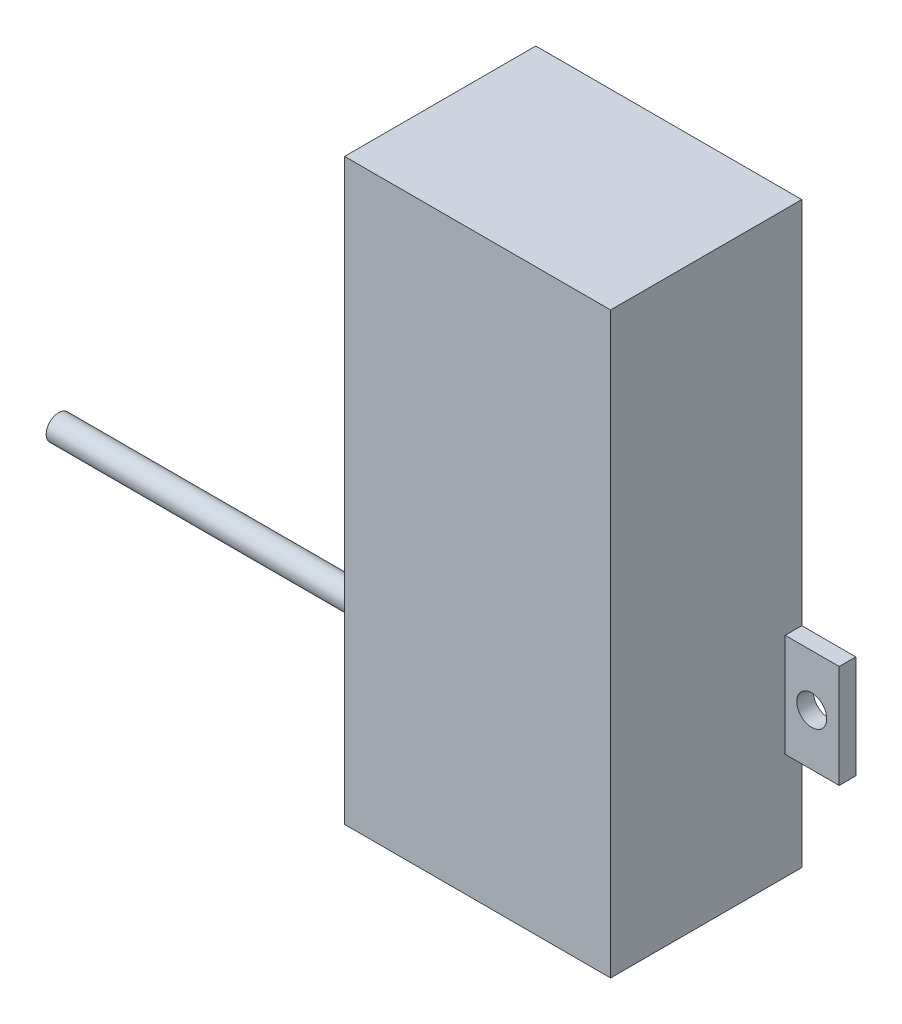
ISO-10303-21;
HEADER;
FILE_DESCRIPTION(('STEP AP214'),'2;1');
FILE_NAME('part.step','',(''),(''),'','','');
FILE_SCHEMA(('AUTOMOTIVE_DESIGN { 1 0 10303 214 1 1 1 1 }'));
ENDSEC;
DATA;
#1=APPLICATION_CONTEXT('core data for automotive mechanical design processes');
#2=APPLICATION_PROTOCOL_DEFINITION('international standard','automotive_design',2000,#1);
#3=PRODUCT_CONTEXT('',#1,'mechanical');
#4=PRODUCT('Part','Part','',(#3));
#5=PRODUCT_RELATED_PRODUCT_CATEGORY('part','',(#4));
#6=PRODUCT_DEFINITION_FORMATION('','',#4);
#7=PRODUCT_DEFINITION_CONTEXT('part definition',#1,'design');
#8=PRODUCT_DEFINITION('design','',#6,#7);
#9=PRODUCT_DEFINITION_SHAPE('','',#8);
#10=(LENGTH_UNIT() NAMED_UNIT(*) SI_UNIT(.MILLI.,.METRE.));
#11=(NAMED_UNIT(*) PLANE_ANGLE_UNIT() SI_UNIT($,.RADIAN.));
#12=(NAMED_UNIT(*) SI_UNIT($,.STERADIAN.) SOLID_ANGLE_UNIT());
#13=UNCERTAINTY_MEASURE_WITH_UNIT(LENGTH_MEASURE(1.E-05),#10,'distance_accuracy_value','');
#14=(GEOMETRIC_REPRESENTATION_CONTEXT(3) GLOBAL_UNCERTAINTY_ASSIGNED_CONTEXT((#13)) GLOBAL_UNIT_ASSIGNED_CONTEXT((#10,
#11,#12)) REPRESENTATION_CONTEXT('',''));
#15=CARTESIAN_POINT('',(0.,0.,0.));
#16=DIRECTION('',(0.,0.,1.));
#17=DIRECTION('',(1.,0.,0.));
#18=AXIS2_PLACEMENT_3D('',#15,#16,#17);
#19=CARTESIAN_POINT('',(34.2790620031797,29.2729411764706,23.));
#20=DIRECTION('',(-1.,0.,0.));
#21=DIRECTION('',(0.,0.,1.));
#22=AXIS2_PLACEMENT_3D('',#19,#20,#21);
#23=PLANE('',#22);
#24=CARTESIAN_POINT('',(34.2790620031797,-27.6270588235294,11.5));
#25=DIRECTION('',(-1.,0.,0.));
#26=DIRECTION('',(0.,0.,1.));
#27=AXIS2_PLACEMENT_3D('',#24,#25,#26);
#28=CIRCLE('',#27,1.5);
#29=CARTESIAN_POINT('',(34.2790620031797,-27.6270588235294,13.));
#30=VERTEX_POINT('',#29);
#31=EDGE_CURVE('E47',#30,#30,#28,.T.);
#32=ORIENTED_EDGE('',*,*,#31,.F.);
#33=EDGE_LOOP('',(#32));
#34=FACE_BOUND('',#33,.T.);
#35=DIRECTION('',(0.,-1.,0.));
#36=VECTOR('',#35,1.);
#37=CARTESIAN_POINT('',(34.2790620031797,-19.5220896505135,2.));
#38=LINE('',#37,#36);
#39=CARTESIAN_POINT('',(34.2790620031797,-15.1220896505135,2.));
#40=VERTEX_POINT('',#39);
#41=CARTESIAN_POINT('',(34.2790620031797,-28.4172027618297,2.));
#42=VERTEX_POINT('',#41);
#43=EDGE_CURVE('E157',#40,#42,#38,.T.);
#44=ORIENTED_EDGE('',*,*,#43,.T.);
#45=DIRECTION('',(0.,0.,1.));
#46=VECTOR('',#45,1.);
#47=CARTESIAN_POINT('',(34.2790620031797,-28.4172027618297,23.));
#48=LINE('',#47,#46);
#49=CARTESIAN_POINT('',(34.2790620031797,-28.4172027618297,0.));
#50=VERTEX_POINT('',#49);
#51=EDGE_CURVE('E11',#50,#42,#48,.T.);
#52=ORIENTED_EDGE('',*,*,#51,.F.);
#53=DIRECTION('',(0.,1.,0.));
#54=VECTOR('',#53,1.);
#55=CARTESIAN_POINT('',(34.2790620031797,29.2729411764706,0.));
#56=LINE('',#55,#54);
#57=CARTESIAN_POINT('',(34.2790620031797,-40.3270588235294,0.));
#58=VERTEX_POINT('',#57);
#59=EDGE_CURVE('E143',#58,#50,#56,.T.);
#60=ORIENTED_EDGE('',*,*,#59,.F.);
#61=DIRECTION('',(0.,0.,-1.));
#62=VECTOR('',#61,1.);
#63=CARTESIAN_POINT('',(34.2790620031797,-40.3270588235294,23.));
#64=LINE('',#63,#62);
#65=CARTESIAN_POINT('',(34.2790620031797,-40.3270588235294,23.));
#66=VERTEX_POINT('',#65);
#67=EDGE_CURVE('E174',#66,#58,#64,.T.);
#68=ORIENTED_EDGE('',*,*,#67,.F.);
#69=DIRECTION('',(0.,1.,0.));
#70=VECTOR('',#69,1.);
#71=CARTESIAN_POINT('',(34.2790620031797,29.2729411764706,23.));
#72=LINE('',#71,#70);
#73=CARTESIAN_POINT('',(34.2790620031797,29.2729411764706,23.));
#74=VERTEX_POINT('',#73);
#75=EDGE_CURVE('E171',#66,#74,#72,.T.);
#76=ORIENTED_EDGE('',*,*,#75,.T.);
#77=DIRECTION('',(0.,0.,-1.));
#78=VECTOR('',#77,1.);
#79=CARTESIAN_POINT('',(34.2790620031797,29.2729411764706,23.));
#80=LINE('',#79,#78);
#81=CARTESIAN_POINT('',(34.2790620031797,29.2729411764706,0.));
#82=VERTEX_POINT('',#81);
#83=EDGE_CURVE('E178',#74,#82,#80,.T.);
#84=ORIENTED_EDGE('',*,*,#83,.T.);
#85=CARTESIAN_POINT('',(34.2790620031797,-15.1220896505135,0.));
#86=VERTEX_POINT('',#85);
#87=EDGE_CURVE('E170',#86,#82,#56,.T.);
#88=ORIENTED_EDGE('',*,*,#87,.F.);
#89=DIRECTION('',(0.,0.,1.));
#90=VECTOR('',#89,1.);
#91=CARTESIAN_POINT('',(34.2790620031797,-15.1220896505135,0.));
#92=LINE('',#91,#90);
#93=EDGE_CURVE('E58',#86,#40,#92,.T.);
#94=ORIENTED_EDGE('',*,*,#93,.T.);
#95=EDGE_LOOP('',(#44,#52,#60,#68,#76,#84,#88,#94));
#96=FACE_BOUND('',#95,.T.);
#97=ADVANCED_FACE('F39',(#34,#96),#23,.T.);
#98=CARTESIAN_POINT('',(66.2790620031797,29.2729411764706,23.));
#99=DIRECTION('',(-1.,0.,0.));
#100=DIRECTION('',(0.,0.,1.));
#101=AXIS2_PLACEMENT_3D('',#98,#99,#100);
#102=PLANE('',#101);
#103=DIRECTION('',(0.,0.,1.));
#104=VECTOR('',#103,1.);
#105=CARTESIAN_POINT('',(66.2790620031797,-27.5220896505135,0.));
#106=LINE('',#105,#104);
#107=CARTESIAN_POINT('',(66.2790620031797,-27.5220896505135,0.));
#108=VERTEX_POINT('',#107);
#109=CARTESIAN_POINT('',(66.2790620031797,-27.5220896505135,2.));
#110=VERTEX_POINT('',#109);
#111=EDGE_CURVE('E181',#108,#110,#106,.T.);
#112=ORIENTED_EDGE('',*,*,#111,.T.);
#113=DIRECTION('',(0.,-1.,0.));
#114=VECTOR('',#113,1.);
#115=CARTESIAN_POINT('',(66.2790620031797,-19.5220896505135,2.));
#116=LINE('',#115,#114);
#117=CARTESIAN_POINT('',(66.2790620031797,-15.1220896505135,2.));
#118=VERTEX_POINT('',#117);
#119=EDGE_CURVE('E198',#118,#110,#116,.T.);
#120=ORIENTED_EDGE('',*,*,#119,.F.);
#121=DIRECTION('',(0.,0.,1.));
#122=VECTOR('',#121,1.);
#123=CARTESIAN_POINT('',(66.2790620031797,-15.1220896505135,0.));
#124=LINE('',#123,#122);
#125=CARTESIAN_POINT('',(66.2790620031797,-15.1220896505135,0.));
#126=VERTEX_POINT('',#125);
#127=EDGE_CURVE('E193',#126,#118,#124,.T.);
#128=ORIENTED_EDGE('',*,*,#127,.F.);
#129=DIRECTION('',(0.,1.,0.));
#130=VECTOR('',#129,1.);
#131=CARTESIAN_POINT('',(66.2790620031797,29.2729411764706,0.));
#132=LINE('',#131,#130);
#133=CARTESIAN_POINT('',(66.2790620031797,29.2729411764706,0.));
#134=VERTEX_POINT('',#133);
#135=EDGE_CURVE('E219',#126,#134,#132,.T.);
#136=ORIENTED_EDGE('',*,*,#135,.T.);
#137=DIRECTION('',(0.,0.,-1.));
#138=VECTOR('',#137,1.);
#139=CARTESIAN_POINT('',(66.2790620031797,29.2729411764706,23.));
#140=LINE('',#139,#138);
#141=CARTESIAN_POINT('',(66.2790620031797,29.2729411764706,23.));
#142=VERTEX_POINT('',#141);
#143=EDGE_CURVE('E217',#142,#134,#140,.T.);
#144=ORIENTED_EDGE('',*,*,#143,.F.);
#145=DIRECTION('',(0.,1.,0.));
#146=VECTOR('',#145,1.);
#147=CARTESIAN_POINT('',(66.2790620031797,29.2729411764706,23.));
#148=LINE('',#147,#146);
#149=CARTESIAN_POINT('',(66.2790620031797,-40.3270588235294,23.));
#150=VERTEX_POINT('',#149);
#151=EDGE_CURVE('E212',#150,#142,#148,.T.);
#152=ORIENTED_EDGE('',*,*,#151,.F.);
#153=DIRECTION('',(0.,0.,-1.));
#154=VECTOR('',#153,1.);
#155=CARTESIAN_POINT('',(66.2790620031797,-40.3270588235294,23.));
#156=LINE('',#155,#154);
#157=CARTESIAN_POINT('',(66.2790620031797,-40.3270588235294,0.));
#158=VERTEX_POINT('',#157);
#159=EDGE_CURVE('E226',#150,#158,#156,.T.);
#160=ORIENTED_EDGE('',*,*,#159,.T.);
#161=EDGE_CURVE('E220',#158,#108,#132,.T.);
#162=ORIENTED_EDGE('',*,*,#161,.T.);
#163=EDGE_LOOP('',(#112,#120,#128,#136,#144,#152,#160,#162));
#164=FACE_BOUND('',#163,.T.);
#165=ADVANCED_FACE('F234',(#164),#102,.F.);
#166=CARTESIAN_POINT('',(0.,0.,0.));
#167=DIRECTION('',(0.,0.,1.));
#168=DIRECTION('',(1.,0.,0.));
#169=AXIS2_PLACEMENT_3D('',#166,#167,#168);
#170=PLANE('',#169);
#171=CARTESIAN_POINT('',(31.0771714081852,-21.7720896505135,0.));
#172=DIRECTION('',(0.,0.,1.));
#173=DIRECTION('',(1.,0.,0.));
#174=AXIS2_PLACEMENT_3D('',#171,#172,#173);
#175=CIRCLE('',#174,1.79810940500553);
#176=CARTESIAN_POINT('',(32.8752808131908,-21.7720896505135,0.));
#177=VERTEX_POINT('',#176);
#178=EDGE_CURVE('E327',#177,#177,#175,.T.);
#179=ORIENTED_EDGE('',*,*,#178,.T.);
#180=EDGE_LOOP('',(#179));
#181=FACE_BOUND('',#180,.T.);
#182=ORIENTED_EDGE('',*,*,#59,.T.);
#183=DIRECTION('',(-1.,0.,0.));
#184=VECTOR('',#183,1.);
#185=CARTESIAN_POINT('',(35.2790620031797,-28.4172027618297,0.));
#186=LINE('',#185,#184);
#187=CARTESIAN_POINT('',(27.7790620031797,-28.4172027618297,0.));
#188=VERTEX_POINT('',#187);
#189=EDGE_CURVE('E140',#50,#188,#186,.T.);
#190=ORIENTED_EDGE('',*,*,#189,.T.);
#191=DIRECTION('',(0.,1.,0.));
#192=VECTOR('',#191,1.);
#193=CARTESIAN_POINT('',(27.7790620031797,-19.5220896505135,0.));
#194=LINE('',#193,#192);
#195=CARTESIAN_POINT('',(27.7790620031797,-15.1220896505135,0.));
#196=VERTEX_POINT('',#195);
#197=EDGE_CURVE('E127',#188,#196,#194,.T.);
#198=ORIENTED_EDGE('',*,*,#197,.T.);
#199=DIRECTION('',(1.,0.,0.));
#200=VECTOR('',#199,1.);
#201=CARTESIAN_POINT('',(27.7790620031797,-15.1220896505135,0.));
#202=LINE('',#201,#200);
#203=EDGE_CURVE('E161',#196,#86,#202,.T.);
#204=ORIENTED_EDGE('',*,*,#203,.T.);
#205=ORIENTED_EDGE('',*,*,#87,.T.);
#206=DIRECTION('',(-1.,0.,0.));
#207=VECTOR('',#206,1.);
#208=CARTESIAN_POINT('',(34.2790620031797,29.2729411764706,0.));
#209=LINE('',#208,#207);
#210=EDGE_CURVE('E213',#134,#82,#209,.T.);
#211=ORIENTED_EDGE('',*,*,#210,.F.);
#212=ORIENTED_EDGE('',*,*,#135,.F.);
#213=DIRECTION('',(-1.,0.,0.));
#214=VECTOR('',#213,1.);
#215=CARTESIAN_POINT('',(72.7790620031797,-15.1220896505135,0.));
#216=LINE('',#215,#214);
#217=CARTESIAN_POINT('',(72.7790620031797,-15.1220896505135,0.));
#218=VERTEX_POINT('',#217);
#219=EDGE_CURVE('E207',#218,#126,#216,.T.);
#220=ORIENTED_EDGE('',*,*,#219,.F.);
#221=DIRECTION('',(0.,1.,0.));
#222=VECTOR('',#221,1.);
#223=CARTESIAN_POINT('',(72.7790620031797,-19.5220896505135,0.));
#224=LINE('',#223,#222);
#225=CARTESIAN_POINT('',(72.7790620031797,-27.5220896505135,0.));
#226=VERTEX_POINT('',#225);
#227=EDGE_CURVE('E194',#226,#218,#224,.T.);
#228=ORIENTED_EDGE('',*,*,#227,.F.);
#229=DIRECTION('',(-1.,0.,0.));
#230=VECTOR('',#229,1.);
#231=CARTESIAN_POINT('',(72.7790620031797,-27.5220896505135,0.));
#232=LINE('',#231,#230);
#233=EDGE_CURVE('E185',#226,#108,#232,.T.);
#234=ORIENTED_EDGE('',*,*,#233,.T.);
#235=ORIENTED_EDGE('',*,*,#161,.F.);
#236=DIRECTION('',(1.,0.,0.));
#237=VECTOR('',#236,1.);
#238=CARTESIAN_POINT('',(34.2790620031797,-40.3270588235294,0.));
#239=LINE('',#238,#237);
#240=EDGE_CURVE('E209',#58,#158,#239,.T.);
#241=ORIENTED_EDGE('',*,*,#240,.F.);
#242=EDGE_LOOP('',(#182,#190,#198,#204,#205,#211,#212,#220,#228,#234,#235,#241));
#243=FACE_BOUND('',#242,.T.);
#244=CARTESIAN_POINT('',(69.4772948209206,-21.3220896505135,0.));
#245=DIRECTION('',(0.,0.,1.));
#246=DIRECTION('',(1.,0.,0.));
#247=AXIS2_PLACEMENT_3D('',#244,#245,#246);
#248=CIRCLE('',#247,1.80176718225915);
#249=CARTESIAN_POINT('',(71.2790620031797,-21.3220896505135,0.));
#250=VERTEX_POINT('',#249);
#251=EDGE_CURVE('E150',#250,#250,#248,.T.);
#252=ORIENTED_EDGE('',*,*,#251,.T.);
#253=EDGE_LOOP('',(#252));
#254=FACE_BOUND('',#253,.T.);
#255=ADVANCED_FACE('F141',(#181,#243,#254),#170,.F.);
#256=CARTESIAN_POINT('',(34.2790620031797,-40.3270588235294,23.));
#257=DIRECTION('',(0.,1.,0.));
#258=DIRECTION('',(0.,0.,1.));
#259=AXIS2_PLACEMENT_3D('',#256,#257,#258);
#260=PLANE('',#259);
#261=DIRECTION('',(1.,0.,0.));
#262=VECTOR('',#261,1.);
#263=CARTESIAN_POINT('',(34.2790620031797,-40.3270588235294,23.));
#264=LINE('',#263,#262);
#265=EDGE_CURVE('E210',#66,#150,#264,.T.);
#266=ORIENTED_EDGE('',*,*,#265,.F.);
#267=ORIENTED_EDGE('',*,*,#67,.T.);
#268=ORIENTED_EDGE('',*,*,#240,.T.);
#269=ORIENTED_EDGE('',*,*,#159,.F.);
#270=EDGE_LOOP('',(#266,#267,#268,#269));
#271=FACE_BOUND('',#270,.T.);
#272=ADVANCED_FACE('F41',(#271),#260,.F.);
#273=CARTESIAN_POINT('',(34.2790620031797,29.2729411764706,23.));
#274=DIRECTION('',(0.,-1.,0.));
#275=DIRECTION('',(0.,0.,-1.));
#276=AXIS2_PLACEMENT_3D('',#273,#274,#275);
#277=PLANE('',#276);
#278=ORIENTED_EDGE('',*,*,#210,.T.);
#279=ORIENTED_EDGE('',*,*,#83,.F.);
#280=DIRECTION('',(-1.,0.,0.));
#281=VECTOR('',#280,1.);
#282=CARTESIAN_POINT('',(34.2790620031797,29.2729411764706,23.));
#283=LINE('',#282,#281);
#284=EDGE_CURVE('E215',#142,#74,#283,.T.);
#285=ORIENTED_EDGE('',*,*,#284,.F.);
#286=ORIENTED_EDGE('',*,*,#143,.T.);
#287=EDGE_LOOP('',(#278,#279,#285,#286));
#288=FACE_BOUND('',#287,.T.);
#289=ADVANCED_FACE('F245',(#288),#277,.F.);
#290=CARTESIAN_POINT('',(0.,0.,23.));
#291=DIRECTION('',(0.,0.,1.));
#292=DIRECTION('',(1.,0.,0.));
#293=AXIS2_PLACEMENT_3D('',#290,#291,#292);
#294=PLANE('',#293);
#295=ORIENTED_EDGE('',*,*,#284,.T.);
#296=ORIENTED_EDGE('',*,*,#75,.F.);
#297=ORIENTED_EDGE('',*,*,#265,.T.);
#298=ORIENTED_EDGE('',*,*,#151,.T.);
#299=EDGE_LOOP('',(#295,#296,#297,#298));
#300=FACE_BOUND('',#299,.T.);
#301=ADVANCED_FACE('F251',(#300),#294,.T.);
#302=CARTESIAN_POINT('',(72.7790620031797,-15.1220896505135,0.));
#303=DIRECTION('',(0.,-1.,0.));
#304=DIRECTION('',(0.,0.,-1.));
#305=AXIS2_PLACEMENT_3D('',#302,#303,#304);
#306=PLANE('',#305);
#307=ORIENTED_EDGE('',*,*,#127,.T.);
#308=DIRECTION('',(-1.,0.,0.));
#309=VECTOR('',#308,1.);
#310=CARTESIAN_POINT('',(72.7790620031797,-15.1220896505135,2.));
#311=LINE('',#310,#309);
#312=CARTESIAN_POINT('',(72.7790620031797,-15.1220896505135,2.));
#313=VERTEX_POINT('',#312);
#314=EDGE_CURVE('E202',#313,#118,#311,.T.);
#315=ORIENTED_EDGE('',*,*,#314,.F.);
#316=DIRECTION('',(0.,0.,1.));
#317=VECTOR('',#316,1.);
#318=CARTESIAN_POINT('',(72.7790620031797,-15.1220896505135,0.));
#319=LINE('',#318,#317);
#320=EDGE_CURVE('E197',#218,#313,#319,.T.);
#321=ORIENTED_EDGE('',*,*,#320,.F.);
#322=ORIENTED_EDGE('',*,*,#219,.T.);
#323=EDGE_LOOP('',(#307,#315,#321,#322));
#324=FACE_BOUND('',#323,.T.);
#325=ADVANCED_FACE('F260',(#324),#306,.F.);
#326=CARTESIAN_POINT('',(72.7790620031797,-19.5220896505135,2.));
#327=DIRECTION('',(0.,0.,-1.));
#328=DIRECTION('',(-1.,0.,0.));
#329=AXIS2_PLACEMENT_3D('',#326,#327,#328);
#330=PLANE('',#329);
#331=CARTESIAN_POINT('',(69.4772948209206,-21.3220896505135,2.));
#332=DIRECTION('',(0.,0.,1.));
#333=DIRECTION('',(1.,0.,0.));
#334=AXIS2_PLACEMENT_3D('',#331,#332,#333);
#335=CIRCLE('',#334,1.80176718225915);
#336=CARTESIAN_POINT('',(71.2790620031797,-21.3220896505135,2.));
#337=VERTEX_POINT('',#336);
#338=EDGE_CURVE('E153',#337,#337,#335,.T.);
#339=ORIENTED_EDGE('',*,*,#338,.F.);
#340=EDGE_LOOP('',(#339));
#341=FACE_BOUND('',#340,.T.);
#342=ORIENTED_EDGE('',*,*,#119,.T.);
#343=DIRECTION('',(-1.,0.,0.));
#344=VECTOR('',#343,1.);
#345=CARTESIAN_POINT('',(72.7790620031797,-27.5220896505135,2.));
#346=LINE('',#345,#344);
#347=CARTESIAN_POINT('',(72.7790620031797,-27.5220896505135,2.));
#348=VERTEX_POINT('',#347);
#349=EDGE_CURVE('E190',#348,#110,#346,.T.);
#350=ORIENTED_EDGE('',*,*,#349,.F.);
#351=DIRECTION('',(0.,-1.,0.));
#352=VECTOR('',#351,1.);
#353=CARTESIAN_POINT('',(72.7790620031797,-19.5220896505135,2.));
#354=LINE('',#353,#352);
#355=EDGE_CURVE('E200',#313,#348,#354,.T.);
#356=ORIENTED_EDGE('',*,*,#355,.F.);
#357=ORIENTED_EDGE('',*,*,#314,.T.);
#358=EDGE_LOOP('',(#342,#350,#356,#357));
#359=FACE_BOUND('',#358,.T.);
#360=ADVANCED_FACE('F289',(#341,#359),#330,.F.);
#361=CARTESIAN_POINT('',(72.7790620031797,0.,0.));
#362=DIRECTION('',(1.,0.,0.));
#363=DIRECTION('',(0.,0.,-1.));
#364=AXIS2_PLACEMENT_3D('',#361,#362,#363);
#365=PLANE('',#364);
#366=ORIENTED_EDGE('',*,*,#227,.T.);
#367=ORIENTED_EDGE('',*,*,#320,.T.);
#368=ORIENTED_EDGE('',*,*,#355,.T.);
#369=DIRECTION('',(0.,0.,1.));
#370=VECTOR('',#369,1.);
#371=CARTESIAN_POINT('',(72.7790620031797,-27.5220896505135,0.));
#372=LINE('',#371,#370);
#373=EDGE_CURVE('E182',#226,#348,#372,.T.);
#374=ORIENTED_EDGE('',*,*,#373,.F.);
#375=EDGE_LOOP('',(#366,#367,#368,#374));
#376=FACE_BOUND('',#375,.T.);
#377=ADVANCED_FACE('F265',(#376),#365,.T.);
#378=CARTESIAN_POINT('',(72.7790620031797,-27.5220896505135,0.));
#379=DIRECTION('',(0.,-1.,0.));
#380=DIRECTION('',(0.,0.,-1.));
#381=AXIS2_PLACEMENT_3D('',#378,#379,#380);
#382=PLANE('',#381);
#383=ORIENTED_EDGE('',*,*,#111,.F.);
#384=ORIENTED_EDGE('',*,*,#233,.F.);
#385=ORIENTED_EDGE('',*,*,#373,.T.);
#386=ORIENTED_EDGE('',*,*,#349,.T.);
#387=EDGE_LOOP('',(#383,#384,#385,#386));
#388=FACE_BOUND('',#387,.T.);
#389=ADVANCED_FACE('F269',(#388),#382,.T.);
#390=CARTESIAN_POINT('',(-11.6209379968203,-27.6270588235294,11.5));
#391=DIRECTION('',(1.,0.,0.));
#392=DIRECTION('',(0.,0.,-1.));
#393=AXIS2_PLACEMENT_3D('',#390,#391,#392);
#394=CYLINDRICAL_SURFACE('',#393,1.5);
#395=CARTESIAN_POINT('',(-11.6209379968203,-27.6270588235294,11.5));
#396=DIRECTION('',(1.,0.,0.));
#397=DIRECTION('',(0.,0.,-1.));
#398=AXIS2_PLACEMENT_3D('',#395,#396,#397);
#399=CIRCLE('',#398,1.5);
#400=CARTESIAN_POINT('',(-11.6209379968203,-27.6270588235294,10.));
#401=VERTEX_POINT('',#400);
#402=EDGE_CURVE('E167',#401,#401,#399,.T.);
#403=ORIENTED_EDGE('',*,*,#402,.T.);
#404=EDGE_LOOP('',(#403));
#405=FACE_BOUND('',#404,.T.);
#406=ORIENTED_EDGE('',*,*,#31,.T.);
#407=EDGE_LOOP('',(#406));
#408=FACE_BOUND('',#407,.T.);
#409=ADVANCED_FACE('F231',(#405,#408),#394,.T.);
#410=CARTESIAN_POINT('',(-11.6209379968203,0.,0.));
#411=DIRECTION('',(-1.,0.,0.));
#412=DIRECTION('',(0.,0.,-1.));
#413=AXIS2_PLACEMENT_3D('',#410,#411,#412);
#414=PLANE('',#413);
#415=ORIENTED_EDGE('',*,*,#402,.F.);
#416=EDGE_LOOP('',(#415));
#417=FACE_BOUND('',#416,.T.);
#418=ADVANCED_FACE('F299',(#417),#414,.T.);
#419=CARTESIAN_POINT('',(27.7790620031797,-19.5220896505135,2.));
#420=DIRECTION('',(0.,0.,1.));
#421=DIRECTION('',(1.,0.,0.));
#422=AXIS2_PLACEMENT_3D('',#419,#420,#421);
#423=PLANE('',#422);
#424=CARTESIAN_POINT('',(31.0771714081852,-21.7720896505135,2.));
#425=DIRECTION('',(0.,0.,1.));
#426=DIRECTION('',(1.,0.,0.));
#427=AXIS2_PLACEMENT_3D('',#424,#425,#426);
#428=CIRCLE('',#427,1.79810940500553);
#429=CARTESIAN_POINT('',(32.8752808131908,-21.7720896505135,2.));
#430=VERTEX_POINT('',#429);
#431=EDGE_CURVE('E325',#430,#430,#428,.T.);
#432=ORIENTED_EDGE('',*,*,#431,.F.);
#433=EDGE_LOOP('',(#432));
#434=FACE_BOUND('',#433,.T.);
#435=DIRECTION('',(-1.,0.,0.));
#436=VECTOR('',#435,1.);
#437=CARTESIAN_POINT('',(35.2790620031797,-28.4172027618297,2.));
#438=LINE('',#437,#436);
#439=CARTESIAN_POINT('',(27.7790620031797,-28.4172027618297,2.));
#440=VERTEX_POINT('',#439);
#441=EDGE_CURVE('E145',#42,#440,#438,.T.);
#442=ORIENTED_EDGE('',*,*,#441,.F.);
#443=ORIENTED_EDGE('',*,*,#43,.F.);
#444=DIRECTION('',(1.,0.,0.));
#445=VECTOR('',#444,1.);
#446=CARTESIAN_POINT('',(27.7790620031797,-15.1220896505135,2.));
#447=LINE('',#446,#445);
#448=CARTESIAN_POINT('',(27.7790620031797,-15.1220896505135,2.));
#449=VERTEX_POINT('',#448);
#450=EDGE_CURVE('E165',#449,#40,#447,.T.);
#451=ORIENTED_EDGE('',*,*,#450,.F.);
#452=DIRECTION('',(0.,-1.,0.));
#453=VECTOR('',#452,1.);
#454=CARTESIAN_POINT('',(27.7790620031797,-19.5220896505135,2.));
#455=LINE('',#454,#453);
#456=EDGE_CURVE('E137',#449,#440,#455,.T.);
#457=ORIENTED_EDGE('',*,*,#456,.T.);
#458=EDGE_LOOP('',(#442,#443,#451,#457));
#459=FACE_BOUND('',#458,.T.);
#460=ADVANCED_FACE('F238',(#434,#459),#423,.T.);
#461=CARTESIAN_POINT('',(27.7790620031797,-15.1220896505135,0.));
#462=DIRECTION('',(0.,1.,0.));
#463=DIRECTION('',(0.,0.,1.));
#464=AXIS2_PLACEMENT_3D('',#461,#462,#463);
#465=PLANE('',#464);
#466=ORIENTED_EDGE('',*,*,#93,.F.);
#467=ORIENTED_EDGE('',*,*,#203,.F.);
#468=DIRECTION('',(0.,0.,1.));
#469=VECTOR('',#468,1.);
#470=CARTESIAN_POINT('',(27.7790620031797,-15.1220896505135,0.));
#471=LINE('',#470,#469);
#472=EDGE_CURVE('E134',#196,#449,#471,.T.);
#473=ORIENTED_EDGE('',*,*,#472,.T.);
#474=ORIENTED_EDGE('',*,*,#450,.T.);
#475=EDGE_LOOP('',(#466,#467,#473,#474));
#476=FACE_BOUND('',#475,.T.);
#477=ADVANCED_FACE('F240',(#476),#465,.T.);
#478=CARTESIAN_POINT('',(27.7790620031797,0.,0.));
#479=DIRECTION('',(-1.,0.,0.));
#480=DIRECTION('',(0.,0.,-1.));
#481=AXIS2_PLACEMENT_3D('',#478,#479,#480);
#482=PLANE('',#481);
#483=ORIENTED_EDGE('',*,*,#197,.F.);
#484=DIRECTION('',(0.,0.,1.));
#485=VECTOR('',#484,1.);
#486=CARTESIAN_POINT('',(27.7790620031797,-28.4172027618297,0.));
#487=LINE('',#486,#485);
#488=EDGE_CURVE('E132',#188,#440,#487,.T.);
#489=ORIENTED_EDGE('',*,*,#488,.T.);
#490=ORIENTED_EDGE('',*,*,#456,.F.);
#491=ORIENTED_EDGE('',*,*,#472,.F.);
#492=EDGE_LOOP('',(#483,#489,#490,#491));
#493=FACE_BOUND('',#492,.T.);
#494=ADVANCED_FACE('F129',(#493),#482,.T.);
#495=CARTESIAN_POINT('',(35.2790620031797,-28.4172027618297,0.));
#496=DIRECTION('',(0.,-1.,0.));
#497=DIRECTION('',(0.,0.,-1.));
#498=AXIS2_PLACEMENT_3D('',#495,#496,#497);
#499=PLANE('',#498);
#500=ORIENTED_EDGE('',*,*,#189,.F.);
#501=ORIENTED_EDGE('',*,*,#51,.T.);
#502=ORIENTED_EDGE('',*,*,#441,.T.);
#503=ORIENTED_EDGE('',*,*,#488,.F.);
#504=EDGE_LOOP('',(#500,#501,#502,#503));
#505=FACE_BOUND('',#504,.T.);
#506=ADVANCED_FACE('F148',(#505),#499,.T.);
#507=CARTESIAN_POINT('',(69.4772948209206,-21.3220896505135,-4.));
#508=DIRECTION('',(0.,0.,1.));
#509=DIRECTION('',(1.,0.,0.));
#510=AXIS2_PLACEMENT_3D('',#507,#508,#509);
#511=CYLINDRICAL_SURFACE('',#510,1.80176718225915);
#512=ORIENTED_EDGE('',*,*,#338,.T.);
#513=EDGE_LOOP('',(#512));
#514=FACE_BOUND('',#513,.T.);
#515=ORIENTED_EDGE('',*,*,#251,.F.);
#516=EDGE_LOOP('',(#515));
#517=FACE_BOUND('',#516,.T.);
#518=ADVANCED_FACE('F313',(#514,#517),#511,.F.);
#519=CARTESIAN_POINT('',(31.0771714081852,-21.7720896505135,-4.));
#520=DIRECTION('',(0.,0.,1.));
#521=DIRECTION('',(1.,0.,0.));
#522=AXIS2_PLACEMENT_3D('',#519,#520,#521);
#523=CYLINDRICAL_SURFACE('',#522,1.79810940500553);
#524=ORIENTED_EDGE('',*,*,#431,.T.);
#525=EDGE_LOOP('',(#524));
#526=FACE_BOUND('',#525,.T.);
#527=ORIENTED_EDGE('',*,*,#178,.F.);
#528=EDGE_LOOP('',(#527));
#529=FACE_BOUND('',#528,.T.);
#530=ADVANCED_FACE('F316',(#526,#529),#523,.F.);
#531=CLOSED_SHELL('',(#97,#165,#255,#272,#289,#301,#325,#360,#377,#389,#409,#418,#460,#477,#494,
#506,#518,#530));
#532=MANIFOLD_SOLID_BREP('B2',#531);
#533=ADVANCED_BREP_SHAPE_REPRESENTATION('',(#18,#532),#14);
#534=SHAPE_DEFINITION_REPRESENTATION(#9,#533);
ENDSEC;
END-ISO-10303-21;
